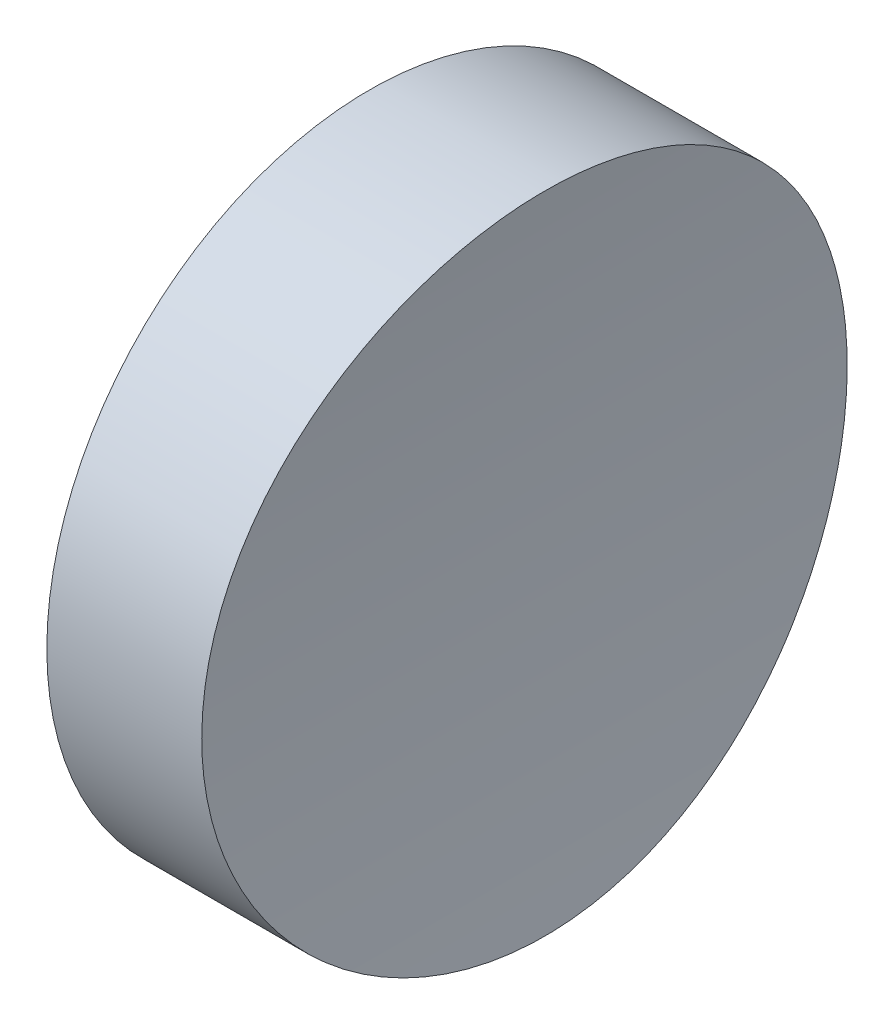
ISO-10303-21;
HEADER;
FILE_DESCRIPTION(('STEP AP214'),'2;1');
FILE_NAME('part.step','',(''),(''),'','','');
FILE_SCHEMA(('AUTOMOTIVE_DESIGN { 1 0 10303 214 1 1 1 1 }'));
ENDSEC;
DATA;
#1=APPLICATION_CONTEXT('core data for automotive mechanical design processes');
#2=APPLICATION_PROTOCOL_DEFINITION('international standard','automotive_design',2000,#1);
#3=PRODUCT_CONTEXT('',#1,'mechanical');
#4=PRODUCT('Part','Part','',(#3));
#5=PRODUCT_RELATED_PRODUCT_CATEGORY('part','',(#4));
#6=PRODUCT_DEFINITION_FORMATION('','',#4);
#7=PRODUCT_DEFINITION_CONTEXT('part definition',#1,'design');
#8=PRODUCT_DEFINITION('design','',#6,#7);
#9=PRODUCT_DEFINITION_SHAPE('','',#8);
#10=(LENGTH_UNIT() NAMED_UNIT(*) SI_UNIT(.MILLI.,.METRE.));
#11=(NAMED_UNIT(*) PLANE_ANGLE_UNIT() SI_UNIT($,.RADIAN.));
#12=(NAMED_UNIT(*) SI_UNIT($,.STERADIAN.) SOLID_ANGLE_UNIT());
#13=UNCERTAINTY_MEASURE_WITH_UNIT(LENGTH_MEASURE(1.E-05),#10,'distance_accuracy_value','');
#14=(GEOMETRIC_REPRESENTATION_CONTEXT(3) GLOBAL_UNCERTAINTY_ASSIGNED_CONTEXT((#13)) GLOBAL_UNIT_ASSIGNED_CONTEXT((#10,
#11,#12)) REPRESENTATION_CONTEXT('',''));
#15=CARTESIAN_POINT('',(0.,0.,0.));
#16=DIRECTION('',(0.,0.,1.));
#17=DIRECTION('',(1.,0.,0.));
#18=AXIS2_PLACEMENT_3D('',#15,#16,#17);
#19=CARTESIAN_POINT('',(10.,0.,0.));
#20=DIRECTION('',(-1.,0.,0.));
#21=DIRECTION('',(0.,0.,1.));
#22=AXIS2_PLACEMENT_3D('',#19,#20,#21);
#23=CYLINDRICAL_SURFACE('',#22,6.25);
#24=CARTESIAN_POINT('',(3.,0.,6.25));
#25=CARTESIAN_POINT('',(2.99999932729531,0.17486264988141,6.25000200680454));
#26=CARTESIAN_POINT('',(3.00091911438067,0.349695840069271,6.24265891316557));
#27=CARTESIAN_POINT('',(3.00457112619082,0.698167683091538,6.21334293466787));
#28=CARTESIAN_POINT('',(3.00730376172519,0.871806056155142,6.19136673379655));
#29=CARTESIAN_POINT('',(3.01450828487551,1.21671821162223,6.13292092945539));
#30=CARTESIAN_POINT('',(3.01898146753249,1.3879901348,6.09644053380669));
#31=CARTESIAN_POINT('',(3.02954260120434,1.72688693599837,6.00924163767552));
#32=CARTESIAN_POINT('',(3.03563114363653,1.8945104538901,5.95851792201508));
#33=CARTESIAN_POINT('',(3.04924376593059,2.22468584941158,5.84327100368695));
#34=CARTESIAN_POINT('',(3.05676633528494,2.38724285598899,5.77876231261219));
#35=CARTESIAN_POINT('',(3.07304336997071,2.70638949214438,5.63635527356306));
#36=CARTESIAN_POINT('',(3.08179828879975,2.8629768978632,5.55845199410803));
#37=CARTESIAN_POINT('',(3.10028800777514,3.16894683367121,5.38987646761822));
#38=CARTESIAN_POINT('',(3.11002226854935,3.31833326335976,5.29921123835918));
#39=CARTESIAN_POINT('',(3.1302069782372,3.60901393981425,5.10568475972976));
#40=CARTESIAN_POINT('',(3.1406576916879,3.75030516183912,5.00281899518832));
#41=CARTESIAN_POINT('',(3.16202932293382,4.02438350855046,4.78514385249439));
#42=CARTESIAN_POINT('',(3.1729521629097,4.15712903782252,4.67028228668928));
#43=CARTESIAN_POINT('',(3.19492013364075,4.41253427474562,4.42976555458967));
#44=CARTESIAN_POINT('',(3.20596530812923,4.53519023415879,4.30410641216351));
#45=CARTESIAN_POINT('',(3.22785909034859,4.7694686097403,4.04294838590132));
#46=CARTESIAN_POINT('',(3.23870775924108,4.8810945088971,3.9074526317909));
#47=CARTESIAN_POINT('',(3.25990949467148,5.09261250622075,3.62747725382448));
#48=CARTESIAN_POINT('',(3.27026237689554,5.19250026036794,3.48299433408552));
#49=CARTESIAN_POINT('',(3.29020426235623,5.38006825952467,3.18564834326277));
#50=CARTESIAN_POINT('',(3.29979087512656,5.46771089536556,3.03276138065916));
#51=CARTESIAN_POINT('',(3.31789381057696,5.62982949762772,2.72002900611881));
#52=CARTESIAN_POINT('',(3.32640973475152,5.70430056582029,2.56018103295227));
#53=CARTESIAN_POINT('',(3.34211758020906,5.83946547351862,2.23476064010075));
#54=CARTESIAN_POINT('',(3.34931002933715,5.90016480790242,2.06919053402172));
#55=CARTESIAN_POINT('',(3.36217068879286,6.00739324508786,1.73344818865727));
#56=CARTESIAN_POINT('',(3.36783833925919,6.05391714391452,1.56327428416321));
#57=CARTESIAN_POINT('',(3.38223037927114,6.1711808545995,1.04958784399827));
#58=CARTESIAN_POINT('',(3.38844743225872,6.22047394635597,0.700829987797434));
#59=CARTESIAN_POINT('',(3.39340227813296,6.2598567136489,0.00013121139921503));
#60=CARTESIAN_POINT('',(3.39214037179019,6.24994876998826,-0.351809580226289));
#61=CARTESIAN_POINT('',(3.38232532347637,6.17153835084882,-1.04699795076385));
#62=CARTESIAN_POINT('',(3.37381383867924,6.10337063717955,-1.39028368237759));
#63=CARTESIAN_POINT('',(3.35052021837612,5.91087722826306,-2.06049133624719));
#64=CARTESIAN_POINT('',(3.33573795582094,5.78655039519991,-2.3874129268071));
#65=CARTESIAN_POINT('',(3.30152204626224,5.48491355801684,-3.01666897972639));
#66=CARTESIAN_POINT('',(3.28207565440442,5.30745804267114,-3.31893297782841));
#67=CARTESIAN_POINT('',(3.24073222954525,4.90470376524444,-3.88951700883965));
#68=CARTESIAN_POINT('',(3.21883508447386,4.67940281482533,-4.15783548826435));
#69=CARTESIAN_POINT('',(3.17487224859552,4.18549775209081,-4.6548567029697));
#70=CARTESIAN_POINT('',(3.15280643921761,3.91660501295583,-4.88327270963727));
#71=CARTESIAN_POINT('',(3.11113418721383,3.34414292942902,-5.29177221985409));
#72=CARTESIAN_POINT('',(3.09152775025907,3.04057350507878,-5.4718556119535));
#73=CARTESIAN_POINT('',(3.05697119423873,2.40715417662496,-5.77857829588452));
#74=CARTESIAN_POINT('',(3.04202263988513,2.07729548785679,-5.90519963338944));
#75=CARTESIAN_POINT('',(3.01848035557493,1.40076985156512,-6.1011762351217));
#76=CARTESIAN_POINT('',(3.00988632811234,1.05410369174296,-6.17053418032197));
#77=CARTESIAN_POINT('',(3.00006008972198,0.356282909618566,-6.24964356067189));
#78=CARTESIAN_POINT('',(2.99877909647363,0.00517372531900025,-6.25978998228802));
#79=CARTESIAN_POINT('',(3.00359154982476,-0.693740091066223,-6.22123066348231));
#80=CARTESIAN_POINT('',(3.00968483937765,-1.04154479336688,-6.17252617638033));
#81=CARTESIAN_POINT('',(3.02853078124918,-1.7228112698469,-6.01797573353669));
#82=CARTESIAN_POINT('',(3.04126148027888,-2.05631642805421,-5.91231811197926));
#83=CARTESIAN_POINT('',(3.07195692186946,-2.70087413515351,-5.64705634973116));
#84=CARTESIAN_POINT('',(3.08992184214841,-3.01192592123623,-5.48745037729689));
#85=CARTESIAN_POINT('',(3.12920442959525,-3.60451130918392,-5.11786723310024));
#86=CARTESIAN_POINT('',(3.15053890772162,-3.88588442778483,-4.90763456305584));
#87=CARTESIAN_POINT('',(3.19412143307392,-4.4094924461394,-4.44312596858315));
#88=CARTESIAN_POINT('',(3.21636951653636,-4.6517257916003,-4.18884829589929));
#89=CARTESIAN_POINT('',(3.25942239641326,-5.09158000188032,-3.64173253769151));
#90=CARTESIAN_POINT('',(3.28021825536876,-5.28893904370931,-3.34868317398833));
#91=CARTESIAN_POINT('',(3.31786460067185,-5.63163183132715,-2.7333503481799));
#92=CARTESIAN_POINT('',(3.33471516610801,-5.77696662004126,-2.41106747227846));
#93=CARTESIAN_POINT('',(3.36250419958137,-6.01106790759924,-1.74732674154748));
#94=CARTESIAN_POINT('',(3.37345808283955,-6.09998201247777,-1.40592148504072));
#95=CARTESIAN_POINT('',(3.38825038993403,-6.21916954108788,-0.712687732995818));
#96=CARTESIAN_POINT('',(3.39208914478503,-6.24944569281599,-0.360859723125625));
#97=CARTESIAN_POINT('',(3.39219826743998,-6.25026504978173,0.16536862539557));
#98=CARTESIAN_POINT('',(3.39130404021255,-6.24319178061111,0.340011531939771));
#99=CARTESIAN_POINT('',(3.38769553857791,-6.21445949803366,0.688056880675981));
#100=CARTESIAN_POINT('',(3.38498194216392,-6.19280591800914,0.861459760648135));
#101=CARTESIAN_POINT('',(3.37780827137805,-6.13505658908522,1.20585879796955));
#102=CARTESIAN_POINT('',(3.37334756182906,-6.09895558760482,1.37685405655987));
#103=CARTESIAN_POINT('',(3.3628106529256,-6.01259732838436,1.71511715467649));
#104=CARTESIAN_POINT('',(3.35673504123678,-5.96234521986165,1.88238632618218));
#105=CARTESIAN_POINT('',(3.34314079654073,-5.84804602544508,2.21208050513683));
#106=CARTESIAN_POINT('',(3.33562216751999,-5.78399897766112,2.37450552596683));
#107=CARTESIAN_POINT('',(3.31935848559845,-5.64259854626254,2.69332132885307));
#108=CARTESIAN_POINT('',(3.31061387811434,-5.56524999298552,2.84971427625704));
#109=CARTESIAN_POINT('',(3.29213964189878,-5.39775107306638,3.15550075986225));
#110=CARTESIAN_POINT('',(3.28240965272367,-5.30759601703144,3.30489170535257));
#111=CARTESIAN_POINT('',(3.26224444749444,-5.11517578135241,3.59553060364154));
#112=CARTESIAN_POINT('',(3.25180948570313,-5.01291495799624,3.73678145862945));
#113=CARTESIAN_POINT('',(3.23044784651044,-4.79620808288634,4.01119290051714));
#114=CARTESIAN_POINT('',(3.21951822301525,-4.6816812657994,4.14428948484251));
#115=CARTESIAN_POINT('',(3.19754912925603,-4.44188850073858,4.40032722504718));
#116=CARTESIAN_POINT('',(3.18650970025173,-4.31662646112227,4.52327204512636));
#117=CARTESIAN_POINT('',(3.16462126133905,-4.05612095971639,4.75827419662147));
#118=CARTESIAN_POINT('',(3.15377237043592,-3.92087151654648,4.87032490905175));
#119=CARTESIAN_POINT('',(3.13258126713343,-3.64145148072077,5.08262796379089));
#120=CARTESIAN_POINT('',(3.12223886905317,-3.49728420188972,5.18288464899322));
#121=CARTESIAN_POINT('',(3.10230583889718,-3.20036625232966,5.37133151917824));
#122=CARTESIAN_POINT('',(3.09271853419251,-3.04758218428092,5.45946944853487));
#123=CARTESIAN_POINT('',(3.0746197632114,-2.73512110918938,5.62251334439789));
#124=CARTESIAN_POINT('',(3.06610790257393,-2.57544665780571,5.69742416526117));
#125=CARTESIAN_POINT('',(3.05040427045803,-2.25040660588946,5.83345352482015));
#126=CARTESIAN_POINT('',(3.04321147001059,-2.08504556195708,5.89458282278232));
#127=CARTESIAN_POINT('',(3.03034396379311,-1.74975252296766,6.00265734644878));
#128=CARTESIAN_POINT('',(3.02466889996921,-1.57982161643017,6.0496059179102));
#129=CARTESIAN_POINT('',(3.01333834651954,-1.17761043469272,6.14261310722837));
#130=CARTESIAN_POINT('',(3.00835738758495,-0.943938622197588,6.18284173989844));
#131=CARTESIAN_POINT('',(3.00168868180295,-0.473493194990547,6.23653372924837));
#132=CARTESIAN_POINT('',(3.00000091067125,-0.236719603164417,6.24999728329649));
#133=CARTESIAN_POINT('',(3.,0.,6.25));
#134=B_SPLINE_CURVE_WITH_KNOTS('',3,(#24,#25,#26,#27,#28,#29,#30,#31,#32,#33,#34,#35,#36,#37,
#38,#39,#40,#41,#42,#43,#44,#45,#46,#47,#48,#49,#50,#51,#52,#53,#54,#55,#56,#57,#58,#59,#60,#61,
#62,#63,#64,#65,#66,#67,#68,#69,#70,#71,#72,#73,#74,#75,#76,#77,#78,#79,#80,#81,#82,#83,#84,#85,
#86,#87,#88,#89,#90,#91,#92,#93,#94,#95,#96,#97,#98,#99,#100,#101,#102,#103,#104,#105,#106,#107,
#108,#109,#110,#111,#112,#113,#114,#115,#116,#117,#118,#119,#120,#121,#122,#123,#124,#125,#126,
#127,#128,#129,#130,#131,#132,#133),.UNSPECIFIED.,.T.,.F.,(4,2,2,2,2,2,2,2,2,2,2,2,2,2,2,2,2,2,
2,2,2,2,2,2,2,2,2,2,2,2,2,2,2,2,2,2,2,2,2,2,2,2,2,2,2,2,2,2,2,2,2,2,2,2,4),(0.,
0.524380797279983,1.04888046510072,1.57377113149825,2.09885423727573,2.62338728174561,
3.14811385849834,3.67255300808731,4.19718685115598,4.72420652899551,5.25142111671214,
5.77846868900779,6.30571069939494,6.8345380441256,7.36356163700194,7.89237377848356,
8.4213798200837,9.47271571482155,10.5240093297801,11.5693024937058,12.6146168368196,
13.6628207398019,14.7110725955045,15.7665720360739,16.8220739104914,17.8779299759537,
18.933736605258,19.9824920674616,21.0312251952117,22.0765114299984,23.1218331596372,
24.1725451558741,25.2232988670407,26.2800343703529,27.336748688202,28.3906869396867,
29.4445761579291,29.9684313675244,30.4920914693767,31.0159421290778,31.5396024189983,
32.0632612622732,32.5867303429578,33.1103916002648,33.6338649864404,34.1610260385257,
34.6879959765561,35.2152841132396,35.7423774757362,36.2716767813171,36.8007814281409,
37.3294715602016,37.8580368571219,38.5679204697118,39.277798847532),.UNSPECIFIED.);
#135=CARTESIAN_POINT('',(3.,0.,6.25));
#136=VERTEX_POINT('',#135);
#137=EDGE_CURVE('E10',#136,#136,#134,.T.);
#138=ORIENTED_EDGE('',*,*,#137,.T.);
#139=EDGE_LOOP('',(#138));
#140=FACE_BOUND('',#139,.T.);
#141=CARTESIAN_POINT('',(0.,0.,0.));
#142=DIRECTION('',(1.,0.,0.));
#143=DIRECTION('',(0.,0.,-1.));
#144=AXIS2_PLACEMENT_3D('',#141,#142,#143);
#145=CIRCLE('',#144,6.25);
#146=CARTESIAN_POINT('',(0.,0.,-6.25));
#147=VERTEX_POINT('',#146);
#148=EDGE_CURVE('E45',#147,#147,#145,.T.);
#149=ORIENTED_EDGE('',*,*,#148,.T.);
#150=EDGE_LOOP('',(#149));
#151=FACE_BOUND('',#150,.T.);
#152=ADVANCED_FACE('F34',(#140,#151),#23,.T.);
#153=CARTESIAN_POINT('',(0.,0.,0.));
#154=DIRECTION('',(1.,0.,0.));
#155=DIRECTION('',(0.,0.,-1.));
#156=AXIS2_PLACEMENT_3D('',#153,#154,#155);
#157=PLANE('',#156);
#158=ORIENTED_EDGE('',*,*,#148,.F.);
#159=EDGE_LOOP('',(#158));
#160=FACE_BOUND('',#159,.T.);
#161=ADVANCED_FACE('F52',(#160),#157,.F.);
#162=CARTESIAN_POINT('',(53.,0.,-6.25));
#163=DIRECTION('',(0.,0.,1.));
#164=DIRECTION('',(1.,0.,0.));
#165=AXIS2_PLACEMENT_3D('',#162,#163,#164);
#166=CYLINDRICAL_SURFACE('',#165,50.);
#167=ORIENTED_EDGE('',*,*,#137,.F.);
#168=EDGE_LOOP('',(#167));
#169=FACE_BOUND('',#168,.T.);
#170=ADVANCED_FACE('F54',(#169),#166,.F.);
#171=CLOSED_SHELL('',(#152,#161,#170));
#172=MANIFOLD_SOLID_BREP('B2',#171);
#173=ADVANCED_BREP_SHAPE_REPRESENTATION('',(#18,#172),#14);
#174=SHAPE_DEFINITION_REPRESENTATION(#9,#173);
ENDSEC;
END-ISO-10303-21;
